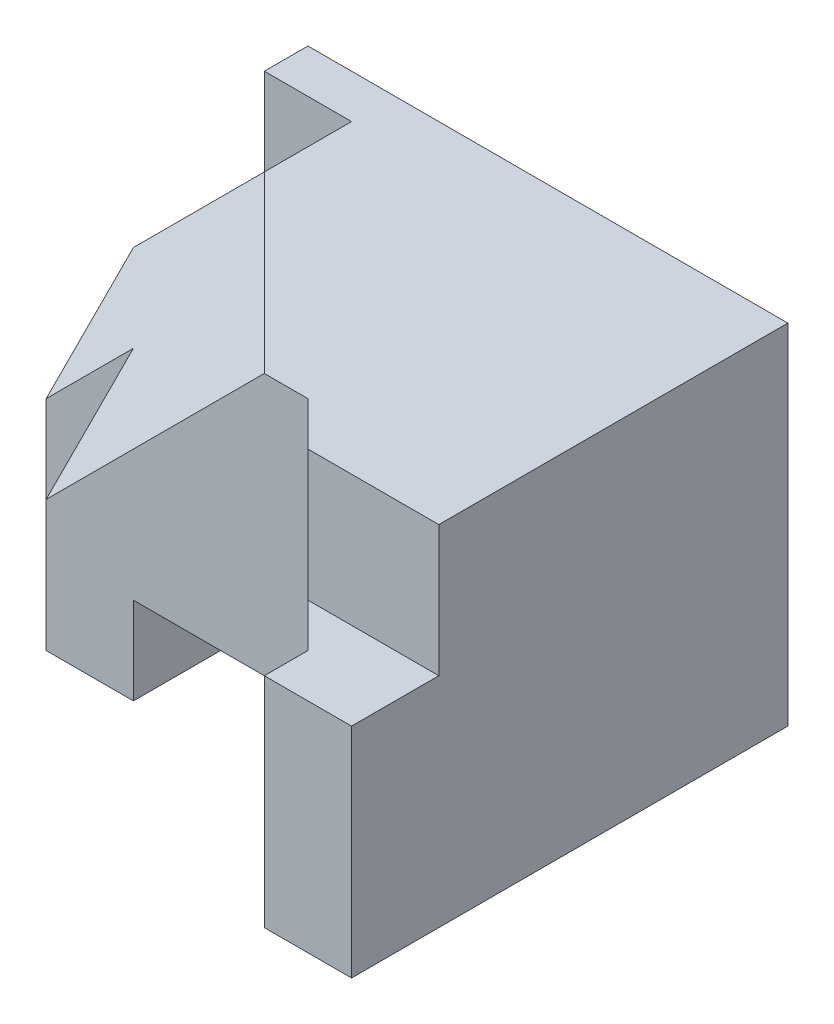
ISO-10303-21;
HEADER;
FILE_DESCRIPTION(('STEP AP214'),'2;1');
FILE_NAME('part.step','',(''),(''),'','','');
FILE_SCHEMA(('AUTOMOTIVE_DESIGN { 1 0 10303 214 1 1 1 1 }'));
ENDSEC;
DATA;
#1=APPLICATION_CONTEXT('core data for automotive mechanical design processes');
#2=APPLICATION_PROTOCOL_DEFINITION('international standard','automotive_design',2000,#1);
#3=PRODUCT_CONTEXT('',#1,'mechanical');
#4=PRODUCT('Part','Part','',(#3));
#5=PRODUCT_RELATED_PRODUCT_CATEGORY('part','',(#4));
#6=PRODUCT_DEFINITION_FORMATION('','',#4);
#7=PRODUCT_DEFINITION_CONTEXT('part definition',#1,'design');
#8=PRODUCT_DEFINITION('design','',#6,#7);
#9=PRODUCT_DEFINITION_SHAPE('','',#8);
#10=(LENGTH_UNIT() NAMED_UNIT(*) SI_UNIT(.MILLI.,.METRE.));
#11=(NAMED_UNIT(*) PLANE_ANGLE_UNIT() SI_UNIT($,.RADIAN.));
#12=(NAMED_UNIT(*) SI_UNIT($,.STERADIAN.) SOLID_ANGLE_UNIT());
#13=UNCERTAINTY_MEASURE_WITH_UNIT(LENGTH_MEASURE(1.E-05),#10,'distance_accuracy_value','');
#14=(GEOMETRIC_REPRESENTATION_CONTEXT(3) GLOBAL_UNCERTAINTY_ASSIGNED_CONTEXT((#13)) GLOBAL_UNIT_ASSIGNED_CONTEXT((#10,
#11,#12)) REPRESENTATION_CONTEXT('',''));
#15=CARTESIAN_POINT('',(0.,0.,0.));
#16=DIRECTION('',(0.,0.,1.));
#17=DIRECTION('',(1.,0.,0.));
#18=AXIS2_PLACEMENT_3D('',#15,#16,#17);
#19=CARTESIAN_POINT('',(0.,0.,-100.));
#20=DIRECTION('',(-1.,0.,0.));
#21=DIRECTION('',(0.,0.,1.));
#22=AXIS2_PLACEMENT_3D('',#19,#20,#21);
#23=PLANE('',#22);
#24=DIRECTION('',(0.,0.,1.));
#25=VECTOR('',#24,1.);
#26=CARTESIAN_POINT('',(0.,0.,-100.));
#27=LINE('',#26,#25);
#28=CARTESIAN_POINT('',(0.,0.,-100.));
#29=VERTEX_POINT('',#28);
#30=CARTESIAN_POINT('',(0.,0.,-50.));
#31=VERTEX_POINT('',#30);
#32=EDGE_CURVE('E231',#29,#31,#27,.T.);
#33=ORIENTED_EDGE('',*,*,#32,.T.);
#34=DIRECTION('',(0.,1.,0.));
#35=VECTOR('',#34,1.);
#36=CARTESIAN_POINT('',(0.,0.,-50.));
#37=LINE('',#36,#35);
#38=CARTESIAN_POINT('',(0.,30.,-50.));
#39=VERTEX_POINT('',#38);
#40=EDGE_CURVE('E170',#31,#39,#37,.T.);
#41=ORIENTED_EDGE('',*,*,#40,.T.);
#42=DIRECTION('',(0.,-0.707106781186548,0.707106781186547));
#43=VECTOR('',#42,1.);
#44=CARTESIAN_POINT('',(0.,30.,-50.));
#45=LINE('',#44,#43);
#46=CARTESIAN_POINT('',(0.,50.0000000000001,-70.));
#47=VERTEX_POINT('',#46);
#48=EDGE_CURVE('E164',#47,#39,#45,.T.);
#49=ORIENTED_EDGE('',*,*,#48,.F.);
#50=DIRECTION('',(0.,0.,1.));
#51=VECTOR('',#50,1.);
#52=CARTESIAN_POINT('',(0.,50.,-100.));
#53=LINE('',#52,#51);
#54=CARTESIAN_POINT('',(0.,50.,-100.));
#55=VERTEX_POINT('',#54);
#56=EDGE_CURVE('E167',#55,#47,#53,.T.);
#57=ORIENTED_EDGE('',*,*,#56,.F.);
#58=DIRECTION('',(0.,-1.,0.));
#59=VECTOR('',#58,1.);
#60=CARTESIAN_POINT('',(0.,0.,-100.));
#61=LINE('',#60,#59);
#62=EDGE_CURVE('E218',#55,#29,#61,.T.);
#63=ORIENTED_EDGE('',*,*,#62,.T.);
#64=EDGE_LOOP('',(#33,#41,#49,#57,#63));
#65=FACE_BOUND('',#64,.T.);
#66=ADVANCED_FACE('F37',(#65),#23,.T.);
#67=CARTESIAN_POINT('',(0.,80.,-100.));
#68=DIRECTION('',(0.,1.,0.));
#69=DIRECTION('',(0.,0.,1.));
#70=AXIS2_PLACEMENT_3D('',#67,#68,#69);
#71=PLANE('',#70);
#72=DIRECTION('',(0.,0.,-1.));
#73=VECTOR('',#72,1.);
#74=CARTESIAN_POINT('',(30.,80.,20.));
#75=LINE('',#74,#73);
#76=CARTESIAN_POINT('',(30.,80.,-70.));
#77=VERTEX_POINT('',#76);
#78=CARTESIAN_POINT('',(30.,80.,-90.));
#79=VERTEX_POINT('',#78);
#80=EDGE_CURVE('E265',#77,#79,#75,.T.);
#81=ORIENTED_EDGE('',*,*,#80,.F.);
#82=DIRECTION('',(-0.707106781186547,0.,-0.707106781186548));
#83=VECTOR('',#82,1.);
#84=CARTESIAN_POINT('',(30.,80.,-70.));
#85=LINE('',#84,#83);
#86=CARTESIAN_POINT('',(70.,80.,-30.));
#87=VERTEX_POINT('',#86);
#88=EDGE_CURVE('E179',#87,#77,#85,.T.);
#89=ORIENTED_EDGE('',*,*,#88,.F.);
#90=DIRECTION('',(-1.,0.,0.));
#91=VECTOR('',#90,1.);
#92=CARTESIAN_POINT('',(0.,80.,-30.));
#93=LINE('',#92,#91);
#94=CARTESIAN_POINT('',(80.,80.,-30.));
#95=VERTEX_POINT('',#94);
#96=EDGE_CURVE('E254',#95,#87,#93,.T.);
#97=ORIENTED_EDGE('',*,*,#96,.F.);
#98=DIRECTION('',(-0.707106781186548,0.,-0.707106781186547));
#99=VECTOR('',#98,1.);
#100=CARTESIAN_POINT('',(4.99999999999996,80.,-105.));
#101=LINE('',#100,#99);
#102=CARTESIAN_POINT('',(90.,80.,-20.));
#103=VERTEX_POINT('',#102);
#104=EDGE_CURVE('E290',#103,#95,#101,.T.);
#105=ORIENTED_EDGE('',*,*,#104,.F.);
#106=DIRECTION('',(-1.,0.,0.));
#107=VECTOR('',#106,1.);
#108=CARTESIAN_POINT('',(120.,80.,-20.));
#109=LINE('',#108,#107);
#110=CARTESIAN_POINT('',(120.,80.,-20.));
#111=VERTEX_POINT('',#110);
#112=EDGE_CURVE('E267',#111,#103,#109,.T.);
#113=ORIENTED_EDGE('',*,*,#112,.F.);
#114=DIRECTION('',(0.,0.,1.));
#115=VECTOR('',#114,1.);
#116=CARTESIAN_POINT('',(120.,80.,-100.));
#117=LINE('',#116,#115);
#118=CARTESIAN_POINT('',(120.,80.,-100.));
#119=VERTEX_POINT('',#118);
#120=EDGE_CURVE('E235',#119,#111,#117,.T.);
#121=ORIENTED_EDGE('',*,*,#120,.F.);
#122=DIRECTION('',(-1.,0.,0.));
#123=VECTOR('',#122,1.);
#124=CARTESIAN_POINT('',(0.,80.,-100.));
#125=LINE('',#124,#123);
#126=CARTESIAN_POINT('',(10.,80.,-100.));
#127=VERTEX_POINT('',#126);
#128=EDGE_CURVE('E228',#119,#127,#125,.T.);
#129=ORIENTED_EDGE('',*,*,#128,.T.);
#130=DIRECTION('',(0.,0.,1.));
#131=VECTOR('',#130,1.);
#132=CARTESIAN_POINT('',(10.,80.,-100.));
#133=LINE('',#132,#131);
#134=CARTESIAN_POINT('',(10.,80.,-90.));
#135=VERTEX_POINT('',#134);
#136=EDGE_CURVE('E192',#127,#135,#133,.T.);
#137=ORIENTED_EDGE('',*,*,#136,.T.);
#138=DIRECTION('',(-1.,0.,0.));
#139=VECTOR('',#138,1.);
#140=CARTESIAN_POINT('',(30.,80.,-90.));
#141=LINE('',#140,#139);
#142=EDGE_CURVE('E182',#79,#135,#141,.T.);
#143=ORIENTED_EDGE('',*,*,#142,.F.);
#144=EDGE_LOOP('',(#81,#89,#97,#105,#113,#121,#129,#137,#143));
#145=FACE_BOUND('',#144,.T.);
#146=ADVANCED_FACE('F310',(#145),#71,.T.);
#147=CARTESIAN_POINT('',(0.,50.,-100.));
#148=DIRECTION('',(0.707106781186547,-0.707106781186548,0.));
#149=DIRECTION('',(0.707106781186548,0.707106781186547,0.));
#150=AXIS2_PLACEMENT_3D('',#147,#148,#149);
#151=PLANE('',#150);
#152=DIRECTION('',(-0.707106781186548,-0.707106781186547,0.));
#153=VECTOR('',#152,1.);
#154=CARTESIAN_POINT('',(0.,50.,-70.));
#155=LINE('',#154,#153);
#156=EDGE_CURVE('E176',#77,#47,#155,.T.);
#157=ORIENTED_EDGE('',*,*,#156,.F.);
#158=ORIENTED_EDGE('',*,*,#80,.T.);
#159=DIRECTION('',(0.707106781186547,0.707106781186548,0.));
#160=VECTOR('',#159,1.);
#161=CARTESIAN_POINT('',(10.,60.,-90.));
#162=LINE('',#161,#160);
#163=CARTESIAN_POINT('',(10.,60.,-90.));
#164=VERTEX_POINT('',#163);
#165=EDGE_CURVE('E262',#164,#79,#162,.T.);
#166=ORIENTED_EDGE('',*,*,#165,.F.);
#167=DIRECTION('',(0.,0.,1.));
#168=VECTOR('',#167,1.);
#169=CARTESIAN_POINT('',(10.,60.,-100.));
#170=LINE('',#169,#168);
#171=CARTESIAN_POINT('',(10.,60.,-100.));
#172=VERTEX_POINT('',#171);
#173=EDGE_CURVE('E188',#172,#164,#170,.T.);
#174=ORIENTED_EDGE('',*,*,#173,.F.);
#175=DIRECTION('',(0.707106781186548,0.707106781186547,0.));
#176=VECTOR('',#175,1.);
#177=CARTESIAN_POINT('',(0.,50.,-100.));
#178=LINE('',#177,#176);
#179=EDGE_CURVE('E187',#55,#172,#178,.T.);
#180=ORIENTED_EDGE('',*,*,#179,.F.);
#181=ORIENTED_EDGE('',*,*,#56,.T.);
#182=EDGE_LOOP('',(#157,#158,#166,#174,#180,#181));
#183=FACE_BOUND('',#182,.T.);
#184=ADVANCED_FACE('F185',(#183),#151,.F.);
#185=CARTESIAN_POINT('',(20.,100.,0.));
#186=DIRECTION('',(1.,0.,0.));
#187=DIRECTION('',(0.,0.,-1.));
#188=AXIS2_PLACEMENT_3D('',#185,#186,#187);
#189=PLANE('',#188);
#190=DIRECTION('',(0.,0.707106781186547,-0.707106781186548));
#191=VECTOR('',#190,1.);
#192=CARTESIAN_POINT('',(20.,0.,0.));
#193=LINE('',#192,#191);
#194=CARTESIAN_POINT('',(20.,30.0000000000001,-30.));
#195=VERTEX_POINT('',#194);
#196=CARTESIAN_POINT('',(20.,50.,-50.));
#197=VERTEX_POINT('',#196);
#198=EDGE_CURVE('E245',#195,#197,#193,.T.);
#199=ORIENTED_EDGE('',*,*,#198,.T.);
#200=DIRECTION('',(0.,-1.,0.));
#201=VECTOR('',#200,1.);
#202=CARTESIAN_POINT('',(20.,100.,-50.));
#203=LINE('',#202,#201);
#204=CARTESIAN_POINT('',(20.,0.,-50.));
#205=VERTEX_POINT('',#204);
#206=EDGE_CURVE('E51',#197,#205,#203,.T.);
#207=ORIENTED_EDGE('',*,*,#206,.T.);
#208=DIRECTION('',(0.,0.,1.));
#209=VECTOR('',#208,1.);
#210=CARTESIAN_POINT('',(20.,0.,0.));
#211=LINE('',#210,#209);
#212=CARTESIAN_POINT('',(20.,0.,-30.));
#213=VERTEX_POINT('',#212);
#214=EDGE_CURVE('E246',#205,#213,#211,.T.);
#215=ORIENTED_EDGE('',*,*,#214,.T.);
#216=DIRECTION('',(0.,1.,0.));
#217=VECTOR('',#216,1.);
#218=CARTESIAN_POINT('',(20.,100.,-30.));
#219=LINE('',#218,#217);
#220=EDGE_CURVE('E44',#213,#195,#219,.T.);
#221=ORIENTED_EDGE('',*,*,#220,.T.);
#222=EDGE_LOOP('',(#199,#207,#215,#221));
#223=FACE_BOUND('',#222,.T.);
#224=ADVANCED_FACE('F244',(#223),#189,.F.);
#225=CARTESIAN_POINT('',(10.,60.,-100.));
#226=DIRECTION('',(1.,0.,0.));
#227=DIRECTION('',(0.,0.,-1.));
#228=AXIS2_PLACEMENT_3D('',#225,#226,#227);
#229=PLANE('',#228);
#230=DIRECTION('',(0.,-1.,0.));
#231=VECTOR('',#230,1.);
#232=CARTESIAN_POINT('',(10.,80.,-90.));
#233=LINE('',#232,#231);
#234=EDGE_CURVE('E260',#135,#164,#233,.T.);
#235=ORIENTED_EDGE('',*,*,#234,.F.);
#236=ORIENTED_EDGE('',*,*,#136,.F.);
#237=DIRECTION('',(0.,1.,0.));
#238=VECTOR('',#237,1.);
#239=CARTESIAN_POINT('',(10.,60.,-100.));
#240=LINE('',#239,#238);
#241=EDGE_CURVE('E189',#172,#127,#240,.T.);
#242=ORIENTED_EDGE('',*,*,#241,.F.);
#243=ORIENTED_EDGE('',*,*,#173,.T.);
#244=EDGE_LOOP('',(#235,#236,#242,#243));
#245=FACE_BOUND('',#244,.T.);
#246=ADVANCED_FACE('F315',(#245),#229,.F.);
#247=CARTESIAN_POINT('',(20.,100.,-30.));
#248=DIRECTION('',(0.,0.,-1.));
#249=DIRECTION('',(-1.,0.,0.));
#250=AXIS2_PLACEMENT_3D('',#247,#248,#249);
#251=PLANE('',#250);
#252=ORIENTED_EDGE('',*,*,#96,.T.);
#253=DIRECTION('',(-0.707106781186548,-0.707106781186547,0.));
#254=VECTOR('',#253,1.);
#255=CARTESIAN_POINT('',(-5.00000000000002,5.00000000000002,-30.));
#256=LINE('',#255,#254);
#257=EDGE_CURVE('E183',#87,#195,#256,.T.);
#258=ORIENTED_EDGE('',*,*,#257,.T.);
#259=ORIENTED_EDGE('',*,*,#220,.F.);
#260=DIRECTION('',(1.,0.,0.));
#261=VECTOR('',#260,1.);
#262=CARTESIAN_POINT('',(20.,0.,-30.));
#263=LINE('',#262,#261);
#264=CARTESIAN_POINT('',(40.,0.,-30.));
#265=VERTEX_POINT('',#264);
#266=EDGE_CURVE('E295',#213,#265,#263,.T.);
#267=ORIENTED_EDGE('',*,*,#266,.T.);
#268=DIRECTION('',(0.,-1.,0.));
#269=VECTOR('',#268,1.);
#270=CARTESIAN_POINT('',(40.,0.,-30.));
#271=LINE('',#270,#269);
#272=CARTESIAN_POINT('',(40.,20.,-30.));
#273=VERTEX_POINT('',#272);
#274=EDGE_CURVE('E302',#273,#265,#271,.T.);
#275=ORIENTED_EDGE('',*,*,#274,.F.);
#276=DIRECTION('',(-1.,0.,0.));
#277=VECTOR('',#276,1.);
#278=CARTESIAN_POINT('',(40.,20.,-30.));
#279=LINE('',#278,#277);
#280=CARTESIAN_POINT('',(80.,20.,-30.));
#281=VERTEX_POINT('',#280);
#282=EDGE_CURVE('E299',#281,#273,#279,.T.);
#283=ORIENTED_EDGE('',*,*,#282,.F.);
#284=DIRECTION('',(0.,-1.,0.));
#285=VECTOR('',#284,1.);
#286=CARTESIAN_POINT('',(80.,100.,-30.));
#287=LINE('',#286,#285);
#288=EDGE_CURVE('E297',#95,#281,#287,.T.);
#289=ORIENTED_EDGE('',*,*,#288,.F.);
#290=EDGE_LOOP('',(#252,#258,#259,#267,#275,#283,#289));
#291=FACE_BOUND('',#290,.T.);
#292=ADVANCED_FACE('F251',(#291),#251,.F.);
#293=CARTESIAN_POINT('',(0.,0.,0.));
#294=DIRECTION('',(0.,0.,-1.));
#295=DIRECTION('',(-1.,0.,0.));
#296=AXIS2_PLACEMENT_3D('',#293,#294,#295);
#297=PLANE('',#296);
#298=DIRECTION('',(1.,0.,0.));
#299=VECTOR('',#298,1.);
#300=CARTESIAN_POINT('',(120.,50.,0.));
#301=LINE('',#300,#299);
#302=CARTESIAN_POINT('',(100.,50.,0.));
#303=VERTEX_POINT('',#302);
#304=CARTESIAN_POINT('',(120.,50.,0.));
#305=VERTEX_POINT('',#304);
#306=EDGE_CURVE('E271',#303,#305,#301,.T.);
#307=ORIENTED_EDGE('',*,*,#306,.F.);
#308=DIRECTION('',(0.,-1.,0.));
#309=VECTOR('',#308,1.);
#310=CARTESIAN_POINT('',(100.,100.,0.));
#311=LINE('',#310,#309);
#312=CARTESIAN_POINT('',(100.,0.,0.));
#313=VERTEX_POINT('',#312);
#314=EDGE_CURVE('E288',#303,#313,#311,.T.);
#315=ORIENTED_EDGE('',*,*,#314,.T.);
#316=DIRECTION('',(1.,0.,0.));
#317=VECTOR('',#316,1.);
#318=CARTESIAN_POINT('',(0.,0.,0.));
#319=LINE('',#318,#317);
#320=CARTESIAN_POINT('',(120.,0.,0.));
#321=VERTEX_POINT('',#320);
#322=EDGE_CURVE('E210',#313,#321,#319,.T.);
#323=ORIENTED_EDGE('',*,*,#322,.T.);
#324=DIRECTION('',(0.,1.,0.));
#325=VECTOR('',#324,1.);
#326=CARTESIAN_POINT('',(120.,0.,0.));
#327=LINE('',#326,#325);
#328=EDGE_CURVE('E221',#321,#305,#327,.T.);
#329=ORIENTED_EDGE('',*,*,#328,.T.);
#330=EDGE_LOOP('',(#307,#315,#323,#329));
#331=FACE_BOUND('',#330,.T.);
#332=ADVANCED_FACE('F350',(#331),#297,.F.);
#333=CARTESIAN_POINT('',(100.,100.,-10.));
#334=DIRECTION('',(1.,0.,0.));
#335=DIRECTION('',(0.,0.,-1.));
#336=AXIS2_PLACEMENT_3D('',#333,#334,#335);
#337=PLANE('',#336);
#338=DIRECTION('',(0.,0.,1.));
#339=VECTOR('',#338,1.);
#340=CARTESIAN_POINT('',(100.,50.,-10.));
#341=LINE('',#340,#339);
#342=CARTESIAN_POINT('',(100.,50.,-10.));
#343=VERTEX_POINT('',#342);
#344=EDGE_CURVE('E278',#343,#303,#341,.T.);
#345=ORIENTED_EDGE('',*,*,#344,.F.);
#346=DIRECTION('',(0.,-1.,0.));
#347=VECTOR('',#346,1.);
#348=CARTESIAN_POINT('',(100.,100.,-10.));
#349=LINE('',#348,#347);
#350=CARTESIAN_POINT('',(100.,0.,-10.));
#351=VERTEX_POINT('',#350);
#352=EDGE_CURVE('E291',#343,#351,#349,.T.);
#353=ORIENTED_EDGE('',*,*,#352,.T.);
#354=DIRECTION('',(0.,0.,1.));
#355=VECTOR('',#354,1.);
#356=CARTESIAN_POINT('',(100.,0.,-10.));
#357=LINE('',#356,#355);
#358=EDGE_CURVE('E284',#351,#313,#357,.T.);
#359=ORIENTED_EDGE('',*,*,#358,.T.);
#360=ORIENTED_EDGE('',*,*,#314,.F.);
#361=EDGE_LOOP('',(#345,#353,#359,#360));
#362=FACE_BOUND('',#361,.T.);
#363=ADVANCED_FACE('F364',(#362),#337,.F.);
#364=CARTESIAN_POINT('',(0.,0.,-100.));
#365=DIRECTION('',(0.,-1.,0.));
#366=DIRECTION('',(0.,0.,-1.));
#367=AXIS2_PLACEMENT_3D('',#364,#365,#366);
#368=PLANE('',#367);
#369=ORIENTED_EDGE('',*,*,#214,.F.);
#370=DIRECTION('',(-1.,0.,0.));
#371=VECTOR('',#370,1.);
#372=CARTESIAN_POINT('',(30.,0.,-50.));
#373=LINE('',#372,#371);
#374=EDGE_CURVE('E325',#205,#31,#373,.T.);
#375=ORIENTED_EDGE('',*,*,#374,.T.);
#376=ORIENTED_EDGE('',*,*,#32,.F.);
#377=DIRECTION('',(1.,0.,0.));
#378=VECTOR('',#377,1.);
#379=CARTESIAN_POINT('',(0.,0.,-100.));
#380=LINE('',#379,#378);
#381=CARTESIAN_POINT('',(40.,0.,-100.));
#382=VERTEX_POINT('',#381);
#383=EDGE_CURVE('E222',#29,#382,#380,.T.);
#384=ORIENTED_EDGE('',*,*,#383,.T.);
#385=DIRECTION('',(0.,0.,1.));
#386=VECTOR('',#385,1.);
#387=CARTESIAN_POINT('',(40.,0.,-100.));
#388=LINE('',#387,#386);
#389=EDGE_CURVE('E207',#382,#265,#388,.T.);
#390=ORIENTED_EDGE('',*,*,#389,.T.);
#391=ORIENTED_EDGE('',*,*,#266,.F.);
#392=EDGE_LOOP('',(#369,#375,#376,#384,#390,#391));
#393=FACE_BOUND('',#392,.T.);
#394=ADVANCED_FACE('F323',(#393),#368,.T.);
#395=CARTESIAN_POINT('',(120.,0.,-100.));
#396=DIRECTION('',(1.,0.,0.));
#397=DIRECTION('',(0.,0.,-1.));
#398=AXIS2_PLACEMENT_3D('',#395,#396,#397);
#399=PLANE('',#398);
#400=DIRECTION('',(0.,1.,0.));
#401=VECTOR('',#400,1.);
#402=CARTESIAN_POINT('',(120.,50.,-20.));
#403=LINE('',#402,#401);
#404=CARTESIAN_POINT('',(120.,50.,-20.));
#405=VERTEX_POINT('',#404);
#406=EDGE_CURVE('E273',#405,#111,#403,.T.);
#407=ORIENTED_EDGE('',*,*,#406,.F.);
#408=DIRECTION('',(0.,0.,-1.));
#409=VECTOR('',#408,1.);
#410=CARTESIAN_POINT('',(120.,50.,0.));
#411=LINE('',#410,#409);
#412=EDGE_CURVE('E268',#305,#405,#411,.T.);
#413=ORIENTED_EDGE('',*,*,#412,.F.);
#414=ORIENTED_EDGE('',*,*,#328,.F.);
#415=DIRECTION('',(0.,0.,1.));
#416=VECTOR('',#415,1.);
#417=CARTESIAN_POINT('',(120.,0.,-100.));
#418=LINE('',#417,#416);
#419=CARTESIAN_POINT('',(120.,0.,-100.));
#420=VERTEX_POINT('',#419);
#421=EDGE_CURVE('E238',#420,#321,#418,.T.);
#422=ORIENTED_EDGE('',*,*,#421,.F.);
#423=DIRECTION('',(0.,1.,0.));
#424=VECTOR('',#423,1.);
#425=CARTESIAN_POINT('',(120.,0.,-100.));
#426=LINE('',#425,#424);
#427=EDGE_CURVE('E225',#420,#119,#426,.T.);
#428=ORIENTED_EDGE('',*,*,#427,.T.);
#429=ORIENTED_EDGE('',*,*,#120,.T.);
#430=EDGE_LOOP('',(#407,#413,#414,#422,#428,#429));
#431=FACE_BOUND('',#430,.T.);
#432=ADVANCED_FACE('F352',(#431),#399,.T.);
#433=ORIENTED_EDGE('',*,*,#358,.F.);
#434=DIRECTION('',(0.707106781186548,0.,0.707106781186547));
#435=VECTOR('',#434,1.);
#436=CARTESIAN_POINT('',(80.,0.,-30.));
#437=LINE('',#436,#435);
#438=CARTESIAN_POINT('',(80.,0.,-30.));
#439=VERTEX_POINT('',#438);
#440=EDGE_CURVE('E281',#439,#351,#437,.T.);
#441=ORIENTED_EDGE('',*,*,#440,.F.);
#442=DIRECTION('',(0.,0.,1.));
#443=VECTOR('',#442,1.);
#444=CARTESIAN_POINT('',(80.,0.,-100.));
#445=LINE('',#444,#443);
#446=CARTESIAN_POINT('',(80.,0.,-100.));
#447=VERTEX_POINT('',#446);
#448=EDGE_CURVE('E214',#447,#439,#445,.T.);
#449=ORIENTED_EDGE('',*,*,#448,.F.);
#450=EDGE_CURVE('E220',#447,#420,#380,.T.);
#451=ORIENTED_EDGE('',*,*,#450,.T.);
#452=ORIENTED_EDGE('',*,*,#421,.T.);
#453=ORIENTED_EDGE('',*,*,#322,.F.);
#454=EDGE_LOOP('',(#433,#441,#449,#451,#452,#453));
#455=FACE_BOUND('',#454,.T.);
#456=ADVANCED_FACE('F354',(#455),#368,.T.);
#457=CARTESIAN_POINT('',(0.,0.,-100.));
#458=DIRECTION('',(0.,0.,-1.));
#459=DIRECTION('',(-1.,0.,0.));
#460=AXIS2_PLACEMENT_3D('',#457,#458,#459);
#461=PLANE('',#460);
#462=DIRECTION('',(-1.,0.,0.));
#463=VECTOR('',#462,1.);
#464=CARTESIAN_POINT('',(40.,20.,-100.));
#465=LINE('',#464,#463);
#466=CARTESIAN_POINT('',(80.,20.,-100.));
#467=VERTEX_POINT('',#466);
#468=CARTESIAN_POINT('',(40.,20.,-100.));
#469=VERTEX_POINT('',#468);
#470=EDGE_CURVE('E204',#467,#469,#465,.T.);
#471=ORIENTED_EDGE('',*,*,#470,.T.);
#472=DIRECTION('',(0.,-1.,0.));
#473=VECTOR('',#472,1.);
#474=CARTESIAN_POINT('',(40.,0.,-100.));
#475=LINE('',#474,#473);
#476=EDGE_CURVE('E198',#469,#382,#475,.T.);
#477=ORIENTED_EDGE('',*,*,#476,.T.);
#478=ORIENTED_EDGE('',*,*,#383,.F.);
#479=ORIENTED_EDGE('',*,*,#62,.F.);
#480=ORIENTED_EDGE('',*,*,#179,.T.);
#481=ORIENTED_EDGE('',*,*,#241,.T.);
#482=ORIENTED_EDGE('',*,*,#128,.F.);
#483=ORIENTED_EDGE('',*,*,#427,.F.);
#484=ORIENTED_EDGE('',*,*,#450,.F.);
#485=DIRECTION('',(0.,1.,0.));
#486=VECTOR('',#485,1.);
#487=CARTESIAN_POINT('',(80.,0.,-100.));
#488=LINE('',#487,#486);
#489=EDGE_CURVE('E201',#447,#467,#488,.T.);
#490=ORIENTED_EDGE('',*,*,#489,.T.);
#491=EDGE_LOOP('',(#471,#477,#478,#479,#480,#481,#482,#483,#484,#490));
#492=FACE_BOUND('',#491,.T.);
#493=ADVANCED_FACE('F317',(#492),#461,.T.);
#494=CARTESIAN_POINT('',(40.,0.,-100.));
#495=DIRECTION('',(-1.,0.,0.));
#496=DIRECTION('',(0.,-1.,0.));
#497=AXIS2_PLACEMENT_3D('',#494,#495,#496);
#498=PLANE('',#497);
#499=DIRECTION('',(0.,0.,1.));
#500=VECTOR('',#499,1.);
#501=CARTESIAN_POINT('',(40.,20.,-100.));
#502=LINE('',#501,#500);
#503=EDGE_CURVE('E208',#469,#273,#502,.T.);
#504=ORIENTED_EDGE('',*,*,#503,.T.);
#505=ORIENTED_EDGE('',*,*,#274,.T.);
#506=ORIENTED_EDGE('',*,*,#389,.F.);
#507=ORIENTED_EDGE('',*,*,#476,.F.);
#508=EDGE_LOOP('',(#504,#505,#506,#507));
#509=FACE_BOUND('',#508,.T.);
#510=ADVANCED_FACE('F361',(#509),#498,.F.);
#511=CARTESIAN_POINT('',(40.,20.,-100.));
#512=DIRECTION('',(0.,1.,0.));
#513=DIRECTION('',(0.,0.,1.));
#514=AXIS2_PLACEMENT_3D('',#511,#512,#513);
#515=PLANE('',#514);
#516=ORIENTED_EDGE('',*,*,#282,.T.);
#517=ORIENTED_EDGE('',*,*,#503,.F.);
#518=ORIENTED_EDGE('',*,*,#470,.F.);
#519=DIRECTION('',(0.,0.,1.));
#520=VECTOR('',#519,1.);
#521=CARTESIAN_POINT('',(80.,20.,-100.));
#522=LINE('',#521,#520);
#523=EDGE_CURVE('E211',#467,#281,#522,.T.);
#524=ORIENTED_EDGE('',*,*,#523,.T.);
#525=EDGE_LOOP('',(#516,#517,#518,#524));
#526=FACE_BOUND('',#525,.T.);
#527=ADVANCED_FACE('F391',(#526),#515,.F.);
#528=CARTESIAN_POINT('',(80.,0.,-100.));
#529=DIRECTION('',(1.,0.,0.));
#530=DIRECTION('',(0.,0.,-1.));
#531=AXIS2_PLACEMENT_3D('',#528,#529,#530);
#532=PLANE('',#531);
#533=ORIENTED_EDGE('',*,*,#448,.T.);
#534=DIRECTION('',(0.,-1.,0.));
#535=VECTOR('',#534,1.);
#536=CARTESIAN_POINT('',(80.,100.,-30.));
#537=LINE('',#536,#535);
#538=EDGE_CURVE('E287',#281,#439,#537,.T.);
#539=ORIENTED_EDGE('',*,*,#538,.F.);
#540=ORIENTED_EDGE('',*,*,#523,.F.);
#541=ORIENTED_EDGE('',*,*,#489,.F.);
#542=EDGE_LOOP('',(#533,#539,#540,#541));
#543=FACE_BOUND('',#542,.T.);
#544=ADVANCED_FACE('F383',(#543),#532,.F.);
#545=CARTESIAN_POINT('',(80.,100.,-30.));
#546=DIRECTION('',(0.707106781186547,0.,-0.707106781186548));
#547=DIRECTION('',(-0.707106781186548,0.,-0.707106781186547));
#548=AXIS2_PLACEMENT_3D('',#545,#546,#547);
#549=PLANE('',#548);
#550=DIRECTION('',(0.707106781186548,0.,0.707106781186547));
#551=VECTOR('',#550,1.);
#552=CARTESIAN_POINT('',(80.,50.,-30.));
#553=LINE('',#552,#551);
#554=CARTESIAN_POINT('',(90.,50.,-20.));
#555=VERTEX_POINT('',#554);
#556=EDGE_CURVE('E11',#555,#343,#553,.T.);
#557=ORIENTED_EDGE('',*,*,#556,.F.);
#558=DIRECTION('',(0.,1.,0.));
#559=VECTOR('',#558,1.);
#560=CARTESIAN_POINT('',(90.,50.,-20.));
#561=LINE('',#560,#559);
#562=EDGE_CURVE('E275',#555,#103,#561,.T.);
#563=ORIENTED_EDGE('',*,*,#562,.T.);
#564=ORIENTED_EDGE('',*,*,#104,.T.);
#565=ORIENTED_EDGE('',*,*,#288,.T.);
#566=ORIENTED_EDGE('',*,*,#538,.T.);
#567=ORIENTED_EDGE('',*,*,#440,.T.);
#568=ORIENTED_EDGE('',*,*,#352,.F.);
#569=EDGE_LOOP('',(#557,#563,#564,#565,#566,#567,#568));
#570=FACE_BOUND('',#569,.T.);
#571=ADVANCED_FACE('F379',(#570),#549,.F.);
#572=CARTESIAN_POINT('',(0.,50.,0.));
#573=DIRECTION('',(0.,1.,0.));
#574=DIRECTION('',(0.,0.,1.));
#575=AXIS2_PLACEMENT_3D('',#572,#573,#574);
#576=PLANE('',#575);
#577=ORIENTED_EDGE('',*,*,#344,.T.);
#578=ORIENTED_EDGE('',*,*,#306,.T.);
#579=ORIENTED_EDGE('',*,*,#412,.T.);
#580=DIRECTION('',(-1.,0.,0.));
#581=VECTOR('',#580,1.);
#582=CARTESIAN_POINT('',(120.,50.,-20.));
#583=LINE('',#582,#581);
#584=EDGE_CURVE('E58',#405,#555,#583,.T.);
#585=ORIENTED_EDGE('',*,*,#584,.T.);
#586=ORIENTED_EDGE('',*,*,#556,.T.);
#587=EDGE_LOOP('',(#577,#578,#579,#585,#586));
#588=FACE_BOUND('',#587,.T.);
#589=ADVANCED_FACE('F382',(#588),#576,.T.);
#590=CARTESIAN_POINT('',(120.,50.,-20.));
#591=DIRECTION('',(0.,0.,-1.));
#592=DIRECTION('',(-1.,0.,0.));
#593=AXIS2_PLACEMENT_3D('',#590,#591,#592);
#594=PLANE('',#593);
#595=ORIENTED_EDGE('',*,*,#112,.T.);
#596=ORIENTED_EDGE('',*,*,#562,.F.);
#597=ORIENTED_EDGE('',*,*,#584,.F.);
#598=ORIENTED_EDGE('',*,*,#406,.T.);
#599=EDGE_LOOP('',(#595,#596,#597,#598));
#600=FACE_BOUND('',#599,.T.);
#601=ADVANCED_FACE('F377',(#600),#594,.F.);
#602=CARTESIAN_POINT('',(0.,0.,-90.));
#603=DIRECTION('',(0.,0.,1.));
#604=DIRECTION('',(1.,0.,0.));
#605=AXIS2_PLACEMENT_3D('',#602,#603,#604);
#606=PLANE('',#605);
#607=ORIENTED_EDGE('',*,*,#142,.T.);
#608=ORIENTED_EDGE('',*,*,#234,.T.);
#609=ORIENTED_EDGE('',*,*,#165,.T.);
#610=EDGE_LOOP('',(#607,#608,#609));
#611=FACE_BOUND('',#610,.T.);
#612=ADVANCED_FACE('F337',(#611),#606,.T.);
#613=CARTESIAN_POINT('',(6.66666666666663,-6.66666666666664,-6.66666666666663));
#614=DIRECTION('',(-0.577350269189626,0.577350269189626,0.577350269189626));
#615=DIRECTION('',(0.,-0.707106781186547,0.707106781186548));
#616=AXIS2_PLACEMENT_3D('',#613,#614,#615);
#617=PLANE('',#616);
#618=ORIENTED_EDGE('',*,*,#156,.T.);
#619=ORIENTED_EDGE('',*,*,#48,.T.);
#620=DIRECTION('',(-0.707106781186548,-0.707106781186548,0.));
#621=VECTOR('',#620,1.);
#622=CARTESIAN_POINT('',(0.,30.,-50.));
#623=LINE('',#622,#621);
#624=EDGE_CURVE('E173',#197,#39,#623,.T.);
#625=ORIENTED_EDGE('',*,*,#624,.F.);
#626=ORIENTED_EDGE('',*,*,#198,.F.);
#627=ORIENTED_EDGE('',*,*,#257,.F.);
#628=ORIENTED_EDGE('',*,*,#88,.T.);
#629=EDGE_LOOP('',(#618,#619,#625,#626,#627,#628));
#630=FACE_BOUND('',#629,.T.);
#631=ADVANCED_FACE('F177',(#630),#617,.T.);
#632=CARTESIAN_POINT('',(30.,0.,-50.));
#633=DIRECTION('',(0.,0.,1.));
#634=DIRECTION('',(1.,0.,0.));
#635=AXIS2_PLACEMENT_3D('',#632,#633,#634);
#636=PLANE('',#635);
#637=ORIENTED_EDGE('',*,*,#624,.T.);
#638=ORIENTED_EDGE('',*,*,#40,.F.);
#639=ORIENTED_EDGE('',*,*,#374,.F.);
#640=ORIENTED_EDGE('',*,*,#206,.F.);
#641=EDGE_LOOP('',(#637,#638,#639,#640));
#642=FACE_BOUND('',#641,.T.);
#643=ADVANCED_FACE('F328',(#642),#636,.T.);
#644=CLOSED_SHELL('',(#66,#146,#184,#224,#246,#292,#332,#363,#394,#432,#456,#493,#510,#527,#544,
#571,#589,#601,#612,#631,#643));
#645=MANIFOLD_SOLID_BREP('B2',#644);
#646=ADVANCED_BREP_SHAPE_REPRESENTATION('',(#18,#645),#14);
#647=SHAPE_DEFINITION_REPRESENTATION(#9,#646);
ENDSEC;
END-ISO-10303-21;
